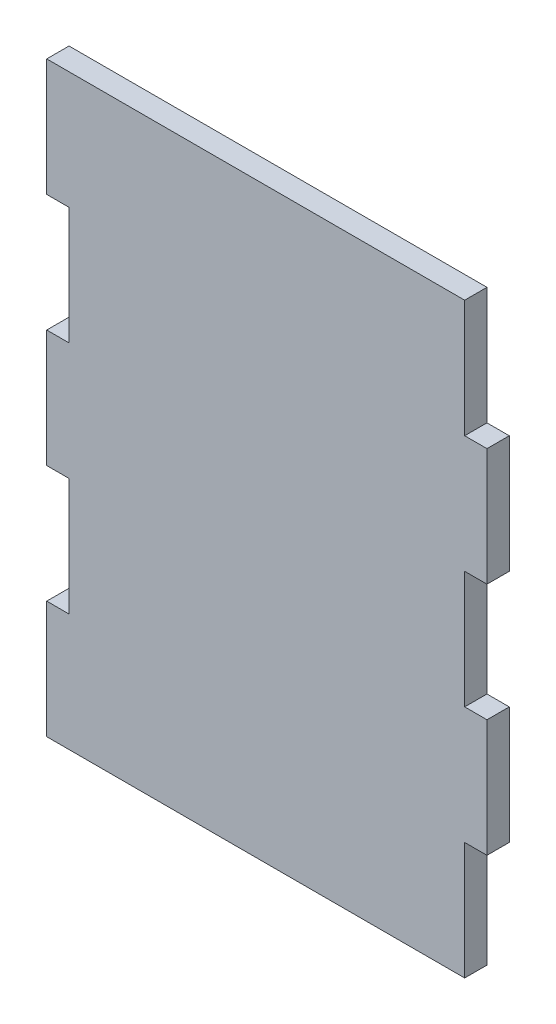
ISO-10303-21;
HEADER;
FILE_DESCRIPTION(('STEP AP214'),'2;1');
FILE_NAME('part.step','',(''),(''),'','','');
FILE_SCHEMA(('AUTOMOTIVE_DESIGN { 1 0 10303 214 1 1 1 1 }'));
ENDSEC;
DATA;
#1=APPLICATION_CONTEXT('core data for automotive mechanical design processes');
#2=APPLICATION_PROTOCOL_DEFINITION('international standard','automotive_design',2000,#1);
#3=PRODUCT_CONTEXT('',#1,'mechanical');
#4=PRODUCT('Part','Part','',(#3));
#5=PRODUCT_RELATED_PRODUCT_CATEGORY('part','',(#4));
#6=PRODUCT_DEFINITION_FORMATION('','',#4);
#7=PRODUCT_DEFINITION_CONTEXT('part definition',#1,'design');
#8=PRODUCT_DEFINITION('design','',#6,#7);
#9=PRODUCT_DEFINITION_SHAPE('','',#8);
#10=(LENGTH_UNIT() NAMED_UNIT(*) SI_UNIT(.MILLI.,.METRE.));
#11=(NAMED_UNIT(*) PLANE_ANGLE_UNIT() SI_UNIT($,.RADIAN.));
#12=(NAMED_UNIT(*) SI_UNIT($,.STERADIAN.) SOLID_ANGLE_UNIT());
#13=UNCERTAINTY_MEASURE_WITH_UNIT(LENGTH_MEASURE(1.E-05),#10,'distance_accuracy_value','');
#14=(GEOMETRIC_REPRESENTATION_CONTEXT(3) GLOBAL_UNCERTAINTY_ASSIGNED_CONTEXT((#13)) GLOBAL_UNIT_ASSIGNED_CONTEXT((#10,
#11,#12)) REPRESENTATION_CONTEXT('',''));
#15=CARTESIAN_POINT('',(0.,0.,0.));
#16=DIRECTION('',(0.,0.,1.));
#17=DIRECTION('',(1.,0.,0.));
#18=AXIS2_PLACEMENT_3D('',#15,#16,#17);
#19=CARTESIAN_POINT('',(42.799,0.,4.826));
#20=DIRECTION('',(1.,0.,0.));
#21=DIRECTION('',(0.,1.,0.));
#22=AXIS2_PLACEMENT_3D('',#19,#20,#21);
#23=PLANE('',#22);
#24=DIRECTION('',(0.,-1.,0.));
#25=VECTOR('',#24,1.);
#26=CARTESIAN_POINT('',(42.799,0.,0.));
#27=LINE('',#26,#25);
#28=CARTESIAN_POINT('',(42.799,-38.1,0.));
#29=VERTEX_POINT('',#28);
#30=CARTESIAN_POINT('',(42.799,-63.5,0.));
#31=VERTEX_POINT('',#30);
#32=EDGE_CURVE('E298',#29,#31,#27,.T.);
#33=ORIENTED_EDGE('',*,*,#32,.F.);
#34=DIRECTION('',(0.,0.,-1.));
#35=VECTOR('',#34,1.);
#36=CARTESIAN_POINT('',(42.799,-38.1,4.826));
#37=LINE('',#36,#35);
#38=CARTESIAN_POINT('',(42.799,-38.1,4.826));
#39=VERTEX_POINT('',#38);
#40=EDGE_CURVE('E11',#39,#29,#37,.T.);
#41=ORIENTED_EDGE('',*,*,#40,.F.);
#42=DIRECTION('',(0.,-1.,0.));
#43=VECTOR('',#42,1.);
#44=CARTESIAN_POINT('',(42.799,0.,4.826));
#45=LINE('',#44,#43);
#46=CARTESIAN_POINT('',(42.799,-63.5,4.826));
#47=VERTEX_POINT('',#46);
#48=EDGE_CURVE('E233',#39,#47,#45,.T.);
#49=ORIENTED_EDGE('',*,*,#48,.T.);
#50=DIRECTION('',(0.,0.,-1.));
#51=VECTOR('',#50,1.);
#52=CARTESIAN_POINT('',(42.799,-63.5,4.826));
#53=LINE('',#52,#51);
#54=EDGE_CURVE('E121',#47,#31,#53,.T.);
#55=ORIENTED_EDGE('',*,*,#54,.T.);
#56=EDGE_LOOP('',(#33,#41,#49,#55));
#57=FACE_BOUND('',#56,.T.);
#58=ADVANCED_FACE('F35',(#57),#23,.T.);
#59=CARTESIAN_POINT('',(1.09561482693271E-13,-38.1000000000002,4.826));
#60=DIRECTION('',(0.,-1.,0.));
#61=DIRECTION('',(1.,0.,0.));
#62=AXIS2_PLACEMENT_3D('',#59,#60,#61);
#63=PLANE('',#62);
#64=DIRECTION('',(-1.,0.,0.));
#65=VECTOR('',#64,1.);
#66=CARTESIAN_POINT('',(1.09561482693271E-13,-38.1000000000002,0.));
#67=LINE('',#66,#65);
#68=CARTESIAN_POINT('',(47.625,-38.1,0.));
#69=VERTEX_POINT('',#68);
#70=EDGE_CURVE('E291',#69,#29,#67,.T.);
#71=ORIENTED_EDGE('',*,*,#70,.F.);
#72=DIRECTION('',(0.,0.,-1.));
#73=VECTOR('',#72,1.);
#74=CARTESIAN_POINT('',(47.625,-38.1,4.826));
#75=LINE('',#74,#73);
#76=CARTESIAN_POINT('',(47.625,-38.1,4.826));
#77=VERTEX_POINT('',#76);
#78=EDGE_CURVE('E43',#77,#69,#75,.T.);
#79=ORIENTED_EDGE('',*,*,#78,.F.);
#80=DIRECTION('',(-1.,0.,0.));
#81=VECTOR('',#80,1.);
#82=CARTESIAN_POINT('',(1.09561482693271E-13,-38.1000000000002,4.826));
#83=LINE('',#82,#81);
#84=EDGE_CURVE('E230',#77,#39,#83,.T.);
#85=ORIENTED_EDGE('',*,*,#84,.T.);
#86=ORIENTED_EDGE('',*,*,#40,.T.);
#87=EDGE_LOOP('',(#71,#79,#85,#86));
#88=FACE_BOUND('',#87,.T.);
#89=ADVANCED_FACE('F297',(#88),#63,.T.);
#90=CARTESIAN_POINT('',(47.625,0.,4.826));
#91=DIRECTION('',(-1.,0.,0.));
#92=DIRECTION('',(0.,0.,1.));
#93=AXIS2_PLACEMENT_3D('',#90,#91,#92);
#94=PLANE('',#93);
#95=DIRECTION('',(0.,1.,0.));
#96=VECTOR('',#95,1.);
#97=CARTESIAN_POINT('',(47.625,0.,0.));
#98=LINE('',#97,#96);
#99=CARTESIAN_POINT('',(47.625,-12.7,0.));
#100=VERTEX_POINT('',#99);
#101=EDGE_CURVE('E283',#69,#100,#98,.T.);
#102=ORIENTED_EDGE('',*,*,#101,.T.);
#103=DIRECTION('',(0.,0.,-1.));
#104=VECTOR('',#103,1.);
#105=CARTESIAN_POINT('',(47.625,-12.7,4.826));
#106=LINE('',#105,#104);
#107=CARTESIAN_POINT('',(47.625,-12.7,4.826));
#108=VERTEX_POINT('',#107);
#109=EDGE_CURVE('E276',#108,#100,#106,.T.);
#110=ORIENTED_EDGE('',*,*,#109,.F.);
#111=DIRECTION('',(0.,1.,0.));
#112=VECTOR('',#111,1.);
#113=CARTESIAN_POINT('',(47.625,0.,4.826));
#114=LINE('',#113,#112);
#115=EDGE_CURVE('E228',#77,#108,#114,.T.);
#116=ORIENTED_EDGE('',*,*,#115,.F.);
#117=ORIENTED_EDGE('',*,*,#78,.T.);
#118=EDGE_LOOP('',(#102,#110,#116,#117));
#119=FACE_BOUND('',#118,.T.);
#120=ADVANCED_FACE('F281',(#119),#94,.F.);
#121=CARTESIAN_POINT('',(0.,-12.7,4.826));
#122=DIRECTION('',(0.,-1.,0.));
#123=DIRECTION('',(1.,0.,0.));
#124=AXIS2_PLACEMENT_3D('',#121,#122,#123);
#125=PLANE('',#124);
#126=DIRECTION('',(-1.,0.,0.));
#127=VECTOR('',#126,1.);
#128=CARTESIAN_POINT('',(0.,-12.7,0.));
#129=LINE('',#128,#127);
#130=CARTESIAN_POINT('',(42.799,-12.7,0.));
#131=VERTEX_POINT('',#130);
#132=EDGE_CURVE('E294',#100,#131,#129,.T.);
#133=ORIENTED_EDGE('',*,*,#132,.T.);
#134=DIRECTION('',(0.,0.,-1.));
#135=VECTOR('',#134,1.);
#136=CARTESIAN_POINT('',(42.799,-12.7,4.826));
#137=LINE('',#136,#135);
#138=CARTESIAN_POINT('',(42.799,-12.7,4.826));
#139=VERTEX_POINT('',#138);
#140=EDGE_CURVE('E274',#139,#131,#137,.T.);
#141=ORIENTED_EDGE('',*,*,#140,.F.);
#142=DIRECTION('',(-1.,0.,0.));
#143=VECTOR('',#142,1.);
#144=CARTESIAN_POINT('',(0.,-12.7,4.826));
#145=LINE('',#144,#143);
#146=EDGE_CURVE('E226',#108,#139,#145,.T.);
#147=ORIENTED_EDGE('',*,*,#146,.F.);
#148=ORIENTED_EDGE('',*,*,#109,.T.);
#149=EDGE_LOOP('',(#133,#141,#147,#148));
#150=FACE_BOUND('',#149,.T.);
#151=ADVANCED_FACE('F339',(#150),#125,.F.);
#152=CARTESIAN_POINT('',(42.799,0.,4.826));
#153=DIRECTION('',(1.,0.,0.));
#154=DIRECTION('',(0.,1.,0.));
#155=AXIS2_PLACEMENT_3D('',#152,#153,#154);
#156=PLANE('',#155);
#157=DIRECTION('',(0.,-1.,0.));
#158=VECTOR('',#157,1.);
#159=CARTESIAN_POINT('',(42.799,0.,0.));
#160=LINE('',#159,#158);
#161=CARTESIAN_POINT('',(42.7989999999999,12.7,0.));
#162=VERTEX_POINT('',#161);
#163=EDGE_CURVE('E303',#162,#131,#160,.T.);
#164=ORIENTED_EDGE('',*,*,#163,.F.);
#165=DIRECTION('',(0.,0.,-1.));
#166=VECTOR('',#165,1.);
#167=CARTESIAN_POINT('',(42.7989999999999,12.7,4.826));
#168=LINE('',#167,#166);
#169=CARTESIAN_POINT('',(42.7989999999999,12.7,4.826));
#170=VERTEX_POINT('',#169);
#171=EDGE_CURVE('E272',#170,#162,#168,.T.);
#172=ORIENTED_EDGE('',*,*,#171,.F.);
#173=DIRECTION('',(0.,-1.,0.));
#174=VECTOR('',#173,1.);
#175=CARTESIAN_POINT('',(42.799,0.,4.826));
#176=LINE('',#175,#174);
#177=EDGE_CURVE('E223',#170,#139,#176,.T.);
#178=ORIENTED_EDGE('',*,*,#177,.T.);
#179=ORIENTED_EDGE('',*,*,#140,.T.);
#180=EDGE_LOOP('',(#164,#172,#178,#179));
#181=FACE_BOUND('',#180,.T.);
#182=ADVANCED_FACE('F345',(#181),#156,.T.);
#183=CARTESIAN_POINT('',(0.,12.7000000000002,4.826));
#184=DIRECTION('',(0.,-1.,0.));
#185=DIRECTION('',(1.,0.,0.));
#186=AXIS2_PLACEMENT_3D('',#183,#184,#185);
#187=PLANE('',#186);
#188=DIRECTION('',(-1.,0.,0.));
#189=VECTOR('',#188,1.);
#190=CARTESIAN_POINT('',(0.,12.7000000000002,0.));
#191=LINE('',#190,#189);
#192=CARTESIAN_POINT('',(47.625,12.7,0.));
#193=VERTEX_POINT('',#192);
#194=EDGE_CURVE('E305',#193,#162,#191,.T.);
#195=ORIENTED_EDGE('',*,*,#194,.F.);
#196=DIRECTION('',(0.,0.,-1.));
#197=VECTOR('',#196,1.);
#198=CARTESIAN_POINT('',(47.625,12.7,4.826));
#199=LINE('',#198,#197);
#200=CARTESIAN_POINT('',(47.625,12.7,4.826));
#201=VERTEX_POINT('',#200);
#202=EDGE_CURVE('E270',#201,#193,#199,.T.);
#203=ORIENTED_EDGE('',*,*,#202,.F.);
#204=DIRECTION('',(-1.,0.,0.));
#205=VECTOR('',#204,1.);
#206=CARTESIAN_POINT('',(0.,12.7000000000002,4.826));
#207=LINE('',#206,#205);
#208=EDGE_CURVE('E220',#201,#170,#207,.T.);
#209=ORIENTED_EDGE('',*,*,#208,.T.);
#210=ORIENTED_EDGE('',*,*,#171,.T.);
#211=EDGE_LOOP('',(#195,#203,#209,#210));
#212=FACE_BOUND('',#211,.T.);
#213=ADVANCED_FACE('F349',(#212),#187,.T.);
#214=CARTESIAN_POINT('',(47.625,38.1,0.));
#215=VERTEX_POINT('',#214);
#216=EDGE_CURVE('E296',#193,#215,#98,.T.);
#217=ORIENTED_EDGE('',*,*,#216,.T.);
#218=DIRECTION('',(0.,0.,-1.));
#219=VECTOR('',#218,1.);
#220=CARTESIAN_POINT('',(47.625,38.1,4.826));
#221=LINE('',#220,#219);
#222=CARTESIAN_POINT('',(47.625,38.1,4.826));
#223=VERTEX_POINT('',#222);
#224=EDGE_CURVE('E267',#223,#215,#221,.T.);
#225=ORIENTED_EDGE('',*,*,#224,.F.);
#226=EDGE_CURVE('E219',#201,#223,#114,.T.);
#227=ORIENTED_EDGE('',*,*,#226,.F.);
#228=ORIENTED_EDGE('',*,*,#202,.T.);
#229=EDGE_LOOP('',(#217,#225,#227,#228));
#230=FACE_BOUND('',#229,.T.);
#231=ADVANCED_FACE('F341',(#230),#94,.F.);
#232=CARTESIAN_POINT('',(3.28684448079815E-13,38.1000000000004,4.826));
#233=DIRECTION('',(0.,-1.,0.));
#234=DIRECTION('',(1.,0.,0.));
#235=AXIS2_PLACEMENT_3D('',#232,#233,#234);
#236=PLANE('',#235);
#237=DIRECTION('',(-1.,0.,0.));
#238=VECTOR('',#237,1.);
#239=CARTESIAN_POINT('',(3.28684448079815E-13,38.1000000000004,0.));
#240=LINE('',#239,#238);
#241=CARTESIAN_POINT('',(42.7989999999999,38.1,0.));
#242=VERTEX_POINT('',#241);
#243=EDGE_CURVE('E308',#215,#242,#240,.T.);
#244=ORIENTED_EDGE('',*,*,#243,.T.);
#245=DIRECTION('',(0.,0.,-1.));
#246=VECTOR('',#245,1.);
#247=CARTESIAN_POINT('',(42.7989999999999,38.1,4.826));
#248=LINE('',#247,#246);
#249=CARTESIAN_POINT('',(42.7989999999999,38.1,4.826));
#250=VERTEX_POINT('',#249);
#251=EDGE_CURVE('E265',#250,#242,#248,.T.);
#252=ORIENTED_EDGE('',*,*,#251,.F.);
#253=DIRECTION('',(-1.,0.,0.));
#254=VECTOR('',#253,1.);
#255=CARTESIAN_POINT('',(3.28684448079815E-13,38.1000000000004,4.826));
#256=LINE('',#255,#254);
#257=EDGE_CURVE('E215',#223,#250,#256,.T.);
#258=ORIENTED_EDGE('',*,*,#257,.F.);
#259=ORIENTED_EDGE('',*,*,#224,.T.);
#260=EDGE_LOOP('',(#244,#252,#258,#259));
#261=FACE_BOUND('',#260,.T.);
#262=ADVANCED_FACE('F355',(#261),#236,.F.);
#263=CARTESIAN_POINT('',(42.7989999999999,0.,4.826));
#264=DIRECTION('',(1.,0.,0.));
#265=DIRECTION('',(0.,1.,0.));
#266=AXIS2_PLACEMENT_3D('',#263,#264,#265);
#267=PLANE('',#266);
#268=DIRECTION('',(0.,-1.,0.));
#269=VECTOR('',#268,1.);
#270=CARTESIAN_POINT('',(42.7989999999999,0.,0.));
#271=LINE('',#270,#269);
#272=CARTESIAN_POINT('',(42.7989999999999,63.5,0.));
#273=VERTEX_POINT('',#272);
#274=EDGE_CURVE('E311',#273,#242,#271,.T.);
#275=ORIENTED_EDGE('',*,*,#274,.F.);
#276=DIRECTION('',(0.,0.,-1.));
#277=VECTOR('',#276,1.);
#278=CARTESIAN_POINT('',(42.7989999999999,63.5,4.826));
#279=LINE('',#278,#277);
#280=CARTESIAN_POINT('',(42.7989999999999,63.5,4.826));
#281=VERTEX_POINT('',#280);
#282=EDGE_CURVE('E263',#281,#273,#279,.T.);
#283=ORIENTED_EDGE('',*,*,#282,.F.);
#284=DIRECTION('',(0.,-1.,0.));
#285=VECTOR('',#284,1.);
#286=CARTESIAN_POINT('',(42.7989999999999,0.,4.826));
#287=LINE('',#286,#285);
#288=EDGE_CURVE('E211',#281,#250,#287,.T.);
#289=ORIENTED_EDGE('',*,*,#288,.T.);
#290=ORIENTED_EDGE('',*,*,#251,.T.);
#291=EDGE_LOOP('',(#275,#283,#289,#290));
#292=FACE_BOUND('',#291,.T.);
#293=ADVANCED_FACE('F359',(#292),#267,.T.);
#294=CARTESIAN_POINT('',(0.,63.5,4.826));
#295=DIRECTION('',(0.,1.,0.));
#296=DIRECTION('',(0.,0.,1.));
#297=AXIS2_PLACEMENT_3D('',#294,#295,#296);
#298=PLANE('',#297);
#299=DIRECTION('',(1.,0.,0.));
#300=VECTOR('',#299,1.);
#301=CARTESIAN_POINT('',(0.,63.5,0.));
#302=LINE('',#301,#300);
#303=CARTESIAN_POINT('',(-47.625,63.5,0.));
#304=VERTEX_POINT('',#303);
#305=EDGE_CURVE('E314',#304,#273,#302,.T.);
#306=ORIENTED_EDGE('',*,*,#305,.F.);
#307=DIRECTION('',(0.,0.,-1.));
#308=VECTOR('',#307,1.);
#309=CARTESIAN_POINT('',(-47.625,63.5,4.826));
#310=LINE('',#309,#308);
#311=CARTESIAN_POINT('',(-47.625,63.5,4.826));
#312=VERTEX_POINT('',#311);
#313=EDGE_CURVE('E261',#312,#304,#310,.T.);
#314=ORIENTED_EDGE('',*,*,#313,.F.);
#315=DIRECTION('',(1.,0.,0.));
#316=VECTOR('',#315,1.);
#317=CARTESIAN_POINT('',(0.,63.5,4.826));
#318=LINE('',#317,#316);
#319=EDGE_CURVE('E206',#312,#281,#318,.T.);
#320=ORIENTED_EDGE('',*,*,#319,.T.);
#321=ORIENTED_EDGE('',*,*,#282,.T.);
#322=EDGE_LOOP('',(#306,#314,#320,#321));
#323=FACE_BOUND('',#322,.T.);
#324=ADVANCED_FACE('F363',(#323),#298,.T.);
#325=CARTESIAN_POINT('',(-47.625,0.,4.826));
#326=DIRECTION('',(-1.,0.,0.));
#327=DIRECTION('',(0.,0.,1.));
#328=AXIS2_PLACEMENT_3D('',#325,#326,#327);
#329=PLANE('',#328);
#330=DIRECTION('',(0.,1.,0.));
#331=VECTOR('',#330,1.);
#332=CARTESIAN_POINT('',(-47.625,0.,0.));
#333=LINE('',#332,#331);
#334=CARTESIAN_POINT('',(-47.625,38.1,0.));
#335=VERTEX_POINT('',#334);
#336=EDGE_CURVE('E240',#335,#304,#333,.T.);
#337=ORIENTED_EDGE('',*,*,#336,.F.);
#338=DIRECTION('',(0.,0.,-1.));
#339=VECTOR('',#338,1.);
#340=CARTESIAN_POINT('',(-47.625,38.1,4.826));
#341=LINE('',#340,#339);
#342=CARTESIAN_POINT('',(-47.625,38.1,4.826));
#343=VERTEX_POINT('',#342);
#344=EDGE_CURVE('E259',#343,#335,#341,.T.);
#345=ORIENTED_EDGE('',*,*,#344,.F.);
#346=DIRECTION('',(0.,1.,0.));
#347=VECTOR('',#346,1.);
#348=CARTESIAN_POINT('',(-47.625,0.,4.826));
#349=LINE('',#348,#347);
#350=EDGE_CURVE('E197',#343,#312,#349,.T.);
#351=ORIENTED_EDGE('',*,*,#350,.T.);
#352=ORIENTED_EDGE('',*,*,#313,.T.);
#353=EDGE_LOOP('',(#337,#345,#351,#352));
#354=FACE_BOUND('',#353,.T.);
#355=ADVANCED_FACE('F367',(#354),#329,.T.);
#356=CARTESIAN_POINT('',(0.,38.1,4.826));
#357=DIRECTION('',(0.,1.,0.));
#358=DIRECTION('',(0.,0.,1.));
#359=AXIS2_PLACEMENT_3D('',#356,#357,#358);
#360=PLANE('',#359);
#361=DIRECTION('',(1.,0.,0.));
#362=VECTOR('',#361,1.);
#363=CARTESIAN_POINT('',(0.,38.1,0.));
#364=LINE('',#363,#362);
#365=CARTESIAN_POINT('',(-42.799,38.1,0.));
#366=VERTEX_POINT('',#365);
#367=EDGE_CURVE('E318',#335,#366,#364,.T.);
#368=ORIENTED_EDGE('',*,*,#367,.T.);
#369=DIRECTION('',(0.,0.,-1.));
#370=VECTOR('',#369,1.);
#371=CARTESIAN_POINT('',(-42.799,38.1,4.826));
#372=LINE('',#371,#370);
#373=CARTESIAN_POINT('',(-42.799,38.1,4.826));
#374=VERTEX_POINT('',#373);
#375=EDGE_CURVE('E256',#374,#366,#372,.T.);
#376=ORIENTED_EDGE('',*,*,#375,.F.);
#377=DIRECTION('',(1.,0.,0.));
#378=VECTOR('',#377,1.);
#379=CARTESIAN_POINT('',(0.,38.1,4.826));
#380=LINE('',#379,#378);
#381=EDGE_CURVE('E205',#343,#374,#380,.T.);
#382=ORIENTED_EDGE('',*,*,#381,.F.);
#383=ORIENTED_EDGE('',*,*,#344,.T.);
#384=EDGE_LOOP('',(#368,#376,#382,#383));
#385=FACE_BOUND('',#384,.T.);
#386=ADVANCED_FACE('F368',(#385),#360,.F.);
#387=CARTESIAN_POINT('',(-42.799,0.,4.826));
#388=DIRECTION('',(1.,0.,0.));
#389=DIRECTION('',(0.,0.,-1.));
#390=AXIS2_PLACEMENT_3D('',#387,#388,#389);
#391=PLANE('',#390);
#392=DIRECTION('',(0.,-1.,0.));
#393=VECTOR('',#392,1.);
#394=CARTESIAN_POINT('',(-42.799,0.,0.));
#395=LINE('',#394,#393);
#396=CARTESIAN_POINT('',(-42.799,12.7,0.));
#397=VERTEX_POINT('',#396);
#398=EDGE_CURVE('E320',#366,#397,#395,.T.);
#399=ORIENTED_EDGE('',*,*,#398,.T.);
#400=DIRECTION('',(0.,0.,-1.));
#401=VECTOR('',#400,1.);
#402=CARTESIAN_POINT('',(-42.799,12.7,4.826));
#403=LINE('',#402,#401);
#404=CARTESIAN_POINT('',(-42.799,12.7,4.826));
#405=VERTEX_POINT('',#404);
#406=EDGE_CURVE('E254',#405,#397,#403,.T.);
#407=ORIENTED_EDGE('',*,*,#406,.F.);
#408=DIRECTION('',(0.,-1.,0.));
#409=VECTOR('',#408,1.);
#410=CARTESIAN_POINT('',(-42.799,0.,4.826));
#411=LINE('',#410,#409);
#412=EDGE_CURVE('E209',#374,#405,#411,.T.);
#413=ORIENTED_EDGE('',*,*,#412,.F.);
#414=ORIENTED_EDGE('',*,*,#375,.T.);
#415=EDGE_LOOP('',(#399,#407,#413,#414));
#416=FACE_BOUND('',#415,.T.);
#417=ADVANCED_FACE('F371',(#416),#391,.F.);
#418=CARTESIAN_POINT('',(0.,12.7,4.826));
#419=DIRECTION('',(0.,1.,0.));
#420=DIRECTION('',(-1.,0.,0.));
#421=AXIS2_PLACEMENT_3D('',#418,#419,#420);
#422=PLANE('',#421);
#423=DIRECTION('',(1.,0.,0.));
#424=VECTOR('',#423,1.);
#425=CARTESIAN_POINT('',(0.,12.7,0.));
#426=LINE('',#425,#424);
#427=CARTESIAN_POINT('',(-47.625,12.7,0.));
#428=VERTEX_POINT('',#427);
#429=EDGE_CURVE('E323',#428,#397,#426,.T.);
#430=ORIENTED_EDGE('',*,*,#429,.F.);
#431=DIRECTION('',(0.,0.,-1.));
#432=VECTOR('',#431,1.);
#433=CARTESIAN_POINT('',(-47.625,12.7,4.826));
#434=LINE('',#433,#432);
#435=CARTESIAN_POINT('',(-47.625,12.7,4.826));
#436=VERTEX_POINT('',#435);
#437=EDGE_CURVE('E252',#436,#428,#434,.T.);
#438=ORIENTED_EDGE('',*,*,#437,.F.);
#439=DIRECTION('',(1.,0.,0.));
#440=VECTOR('',#439,1.);
#441=CARTESIAN_POINT('',(0.,12.7,4.826));
#442=LINE('',#441,#440);
#443=EDGE_CURVE('E203',#436,#405,#442,.T.);
#444=ORIENTED_EDGE('',*,*,#443,.T.);
#445=ORIENTED_EDGE('',*,*,#406,.T.);
#446=EDGE_LOOP('',(#430,#438,#444,#445));
#447=FACE_BOUND('',#446,.T.);
#448=ADVANCED_FACE('F375',(#447),#422,.T.);
#449=CARTESIAN_POINT('',(-47.625,-12.7,0.));
#450=VERTEX_POINT('',#449);
#451=EDGE_CURVE('E239',#450,#428,#333,.T.);
#452=ORIENTED_EDGE('',*,*,#451,.F.);
#453=DIRECTION('',(0.,0.,-1.));
#454=VECTOR('',#453,1.);
#455=CARTESIAN_POINT('',(-47.625,-12.7,4.826));
#456=LINE('',#455,#454);
#457=CARTESIAN_POINT('',(-47.625,-12.7,4.826));
#458=VERTEX_POINT('',#457);
#459=EDGE_CURVE('E250',#458,#450,#456,.T.);
#460=ORIENTED_EDGE('',*,*,#459,.F.);
#461=EDGE_CURVE('E196',#458,#436,#349,.T.);
#462=ORIENTED_EDGE('',*,*,#461,.T.);
#463=ORIENTED_EDGE('',*,*,#437,.T.);
#464=EDGE_LOOP('',(#452,#460,#462,#463));
#465=FACE_BOUND('',#464,.T.);
#466=ADVANCED_FACE('F379',(#465),#329,.T.);
#467=CARTESIAN_POINT('',(0.,-12.7000000000002,4.826));
#468=DIRECTION('',(0.,1.,0.));
#469=DIRECTION('',(-1.,0.,0.));
#470=AXIS2_PLACEMENT_3D('',#467,#468,#469);
#471=PLANE('',#470);
#472=DIRECTION('',(1.,0.,0.));
#473=VECTOR('',#472,1.);
#474=CARTESIAN_POINT('',(0.,-12.7000000000002,0.));
#475=LINE('',#474,#473);
#476=CARTESIAN_POINT('',(-42.799,-12.7,0.));
#477=VERTEX_POINT('',#476);
#478=EDGE_CURVE('E326',#450,#477,#475,.T.);
#479=ORIENTED_EDGE('',*,*,#478,.T.);
#480=DIRECTION('',(0.,0.,-1.));
#481=VECTOR('',#480,1.);
#482=CARTESIAN_POINT('',(-42.799,-12.7,4.826));
#483=LINE('',#482,#481);
#484=CARTESIAN_POINT('',(-42.799,-12.7,4.826));
#485=VERTEX_POINT('',#484);
#486=EDGE_CURVE('E247',#485,#477,#483,.T.);
#487=ORIENTED_EDGE('',*,*,#486,.F.);
#488=DIRECTION('',(1.,0.,0.));
#489=VECTOR('',#488,1.);
#490=CARTESIAN_POINT('',(0.,-12.7000000000002,4.826));
#491=LINE('',#490,#489);
#492=EDGE_CURVE('E202',#458,#485,#491,.T.);
#493=ORIENTED_EDGE('',*,*,#492,.F.);
#494=ORIENTED_EDGE('',*,*,#459,.T.);
#495=EDGE_LOOP('',(#479,#487,#493,#494));
#496=FACE_BOUND('',#495,.T.);
#497=ADVANCED_FACE('F381',(#496),#471,.F.);
#498=CARTESIAN_POINT('',(-42.799,0.,4.826));
#499=DIRECTION('',(1.,0.,0.));
#500=DIRECTION('',(0.,1.,0.));
#501=AXIS2_PLACEMENT_3D('',#498,#499,#500);
#502=PLANE('',#501);
#503=DIRECTION('',(0.,-1.,0.));
#504=VECTOR('',#503,1.);
#505=CARTESIAN_POINT('',(-42.799,0.,0.));
#506=LINE('',#505,#504);
#507=CARTESIAN_POINT('',(-42.799,-38.1,0.));
#508=VERTEX_POINT('',#507);
#509=EDGE_CURVE('E327',#477,#508,#506,.T.);
#510=ORIENTED_EDGE('',*,*,#509,.T.);
#511=DIRECTION('',(0.,0.,-1.));
#512=VECTOR('',#511,1.);
#513=CARTESIAN_POINT('',(-42.799,-38.1,4.826));
#514=LINE('',#513,#512);
#515=CARTESIAN_POINT('',(-42.799,-38.1,4.826));
#516=VERTEX_POINT('',#515);
#517=EDGE_CURVE('E186',#516,#508,#514,.T.);
#518=ORIENTED_EDGE('',*,*,#517,.F.);
#519=DIRECTION('',(0.,-1.,0.));
#520=VECTOR('',#519,1.);
#521=CARTESIAN_POINT('',(-42.799,0.,4.826));
#522=LINE('',#521,#520);
#523=EDGE_CURVE('E191',#485,#516,#522,.T.);
#524=ORIENTED_EDGE('',*,*,#523,.F.);
#525=ORIENTED_EDGE('',*,*,#486,.T.);
#526=EDGE_LOOP('',(#510,#518,#524,#525));
#527=FACE_BOUND('',#526,.T.);
#528=ADVANCED_FACE('F384',(#527),#502,.F.);
#529=CARTESIAN_POINT('',(-1.64342224039909E-13,-38.1000000000002,4.826));
#530=DIRECTION('',(0.,1.,0.));
#531=DIRECTION('',(-1.,0.,0.));
#532=AXIS2_PLACEMENT_3D('',#529,#530,#531);
#533=PLANE('',#532);
#534=DIRECTION('',(1.,0.,0.));
#535=VECTOR('',#534,1.);
#536=CARTESIAN_POINT('',(-1.64342224039909E-13,-38.1000000000002,0.));
#537=LINE('',#536,#535);
#538=CARTESIAN_POINT('',(-47.625,-38.1,0.));
#539=VERTEX_POINT('',#538);
#540=EDGE_CURVE('E181',#539,#508,#537,.T.);
#541=ORIENTED_EDGE('',*,*,#540,.F.);
#542=DIRECTION('',(0.,0.,-1.));
#543=VECTOR('',#542,1.);
#544=CARTESIAN_POINT('',(-47.625,-38.1,4.826));
#545=LINE('',#544,#543);
#546=CARTESIAN_POINT('',(-47.625,-38.1,4.826));
#547=VERTEX_POINT('',#546);
#548=EDGE_CURVE('E176',#547,#539,#545,.T.);
#549=ORIENTED_EDGE('',*,*,#548,.F.);
#550=DIRECTION('',(1.,0.,0.));
#551=VECTOR('',#550,1.);
#552=CARTESIAN_POINT('',(-1.64342224039909E-13,-38.1000000000002,4.826));
#553=LINE('',#552,#551);
#554=EDGE_CURVE('E179',#547,#516,#553,.T.);
#555=ORIENTED_EDGE('',*,*,#554,.T.);
#556=ORIENTED_EDGE('',*,*,#517,.T.);
#557=EDGE_LOOP('',(#541,#549,#555,#556));
#558=FACE_BOUND('',#557,.T.);
#559=ADVANCED_FACE('F178',(#558),#533,.T.);
#560=CARTESIAN_POINT('',(-47.625,-63.5,0.));
#561=VERTEX_POINT('',#560);
#562=EDGE_CURVE('E235',#561,#539,#333,.T.);
#563=ORIENTED_EDGE('',*,*,#562,.F.);
#564=DIRECTION('',(0.,0.,-1.));
#565=VECTOR('',#564,1.);
#566=CARTESIAN_POINT('',(-47.625,-63.5,4.826));
#567=LINE('',#566,#565);
#568=CARTESIAN_POINT('',(-47.625,-63.5,4.826));
#569=VERTEX_POINT('',#568);
#570=EDGE_CURVE('E114',#569,#561,#567,.T.);
#571=ORIENTED_EDGE('',*,*,#570,.F.);
#572=EDGE_CURVE('E189',#569,#547,#349,.T.);
#573=ORIENTED_EDGE('',*,*,#572,.T.);
#574=ORIENTED_EDGE('',*,*,#548,.T.);
#575=EDGE_LOOP('',(#563,#571,#573,#574));
#576=FACE_BOUND('',#575,.T.);
#577=ADVANCED_FACE('F194',(#576),#329,.T.);
#578=CARTESIAN_POINT('',(0.,-63.5,4.826));
#579=DIRECTION('',(0.,1.,0.));
#580=DIRECTION('',(0.,0.,1.));
#581=AXIS2_PLACEMENT_3D('',#578,#579,#580);
#582=PLANE('',#581);
#583=DIRECTION('',(1.,0.,0.));
#584=VECTOR('',#583,1.);
#585=CARTESIAN_POINT('',(0.,-63.5,0.));
#586=LINE('',#585,#584);
#587=EDGE_CURVE('E234',#561,#31,#586,.T.);
#588=ORIENTED_EDGE('',*,*,#587,.T.);
#589=ORIENTED_EDGE('',*,*,#54,.F.);
#590=DIRECTION('',(1.,0.,0.));
#591=VECTOR('',#590,1.);
#592=CARTESIAN_POINT('',(0.,-63.5,4.826));
#593=LINE('',#592,#591);
#594=EDGE_CURVE('E51',#569,#47,#593,.T.);
#595=ORIENTED_EDGE('',*,*,#594,.F.);
#596=ORIENTED_EDGE('',*,*,#570,.T.);
#597=EDGE_LOOP('',(#588,#589,#595,#596));
#598=FACE_BOUND('',#597,.T.);
#599=ADVANCED_FACE('F392',(#598),#582,.F.);
#600=CARTESIAN_POINT('',(0.,0.,4.826));
#601=DIRECTION('',(0.,0.,1.));
#602=DIRECTION('',(1.,0.,0.));
#603=AXIS2_PLACEMENT_3D('',#600,#601,#602);
#604=PLANE('',#603);
#605=ORIENTED_EDGE('',*,*,#48,.F.);
#606=ORIENTED_EDGE('',*,*,#84,.F.);
#607=ORIENTED_EDGE('',*,*,#115,.T.);
#608=ORIENTED_EDGE('',*,*,#146,.T.);
#609=ORIENTED_EDGE('',*,*,#177,.F.);
#610=ORIENTED_EDGE('',*,*,#208,.F.);
#611=ORIENTED_EDGE('',*,*,#226,.T.);
#612=ORIENTED_EDGE('',*,*,#257,.T.);
#613=ORIENTED_EDGE('',*,*,#288,.F.);
#614=ORIENTED_EDGE('',*,*,#319,.F.);
#615=ORIENTED_EDGE('',*,*,#350,.F.);
#616=ORIENTED_EDGE('',*,*,#381,.T.);
#617=ORIENTED_EDGE('',*,*,#412,.T.);
#618=ORIENTED_EDGE('',*,*,#443,.F.);
#619=ORIENTED_EDGE('',*,*,#461,.F.);
#620=ORIENTED_EDGE('',*,*,#492,.T.);
#621=ORIENTED_EDGE('',*,*,#523,.T.);
#622=ORIENTED_EDGE('',*,*,#554,.F.);
#623=ORIENTED_EDGE('',*,*,#572,.F.);
#624=ORIENTED_EDGE('',*,*,#594,.T.);
#625=EDGE_LOOP('',(#605,#606,#607,#608,#609,#610,#611,#612,#613,#614,#615,#616,#617,#618,#619,
#620,#621,#622,#623,#624));
#626=FACE_BOUND('',#625,.T.);
#627=ADVANCED_FACE('F188',(#626),#604,.T.);
#628=CARTESIAN_POINT('',(0.,0.,0.));
#629=DIRECTION('',(0.,0.,1.));
#630=DIRECTION('',(1.,0.,0.));
#631=AXIS2_PLACEMENT_3D('',#628,#629,#630);
#632=PLANE('',#631);
#633=ORIENTED_EDGE('',*,*,#32,.T.);
#634=ORIENTED_EDGE('',*,*,#587,.F.);
#635=ORIENTED_EDGE('',*,*,#562,.T.);
#636=ORIENTED_EDGE('',*,*,#540,.T.);
#637=ORIENTED_EDGE('',*,*,#509,.F.);
#638=ORIENTED_EDGE('',*,*,#478,.F.);
#639=ORIENTED_EDGE('',*,*,#451,.T.);
#640=ORIENTED_EDGE('',*,*,#429,.T.);
#641=ORIENTED_EDGE('',*,*,#398,.F.);
#642=ORIENTED_EDGE('',*,*,#367,.F.);
#643=ORIENTED_EDGE('',*,*,#336,.T.);
#644=ORIENTED_EDGE('',*,*,#305,.T.);
#645=ORIENTED_EDGE('',*,*,#274,.T.);
#646=ORIENTED_EDGE('',*,*,#243,.F.);
#647=ORIENTED_EDGE('',*,*,#216,.F.);
#648=ORIENTED_EDGE('',*,*,#194,.T.);
#649=ORIENTED_EDGE('',*,*,#163,.T.);
#650=ORIENTED_EDGE('',*,*,#132,.F.);
#651=ORIENTED_EDGE('',*,*,#101,.F.);
#652=ORIENTED_EDGE('',*,*,#70,.T.);
#653=EDGE_LOOP('',(#633,#634,#635,#636,#637,#638,#639,#640,#641,#642,#643,#644,#645,#646,#647,
#648,#649,#650,#651,#652));
#654=FACE_BOUND('',#653,.T.);
#655=ADVANCED_FACE('F290',(#654),#632,.F.);
#656=CLOSED_SHELL('',(#58,#89,#120,#151,#182,#213,#231,#262,#293,#324,#355,#386,#417,#448,#466,
#497,#528,#559,#577,#599,#627,#655));
#657=MANIFOLD_SOLID_BREP('B2',#656);
#658=ADVANCED_BREP_SHAPE_REPRESENTATION('',(#18,#657),#14);
#659=SHAPE_DEFINITION_REPRESENTATION(#9,#658);
ENDSEC;
END-ISO-10303-21;
